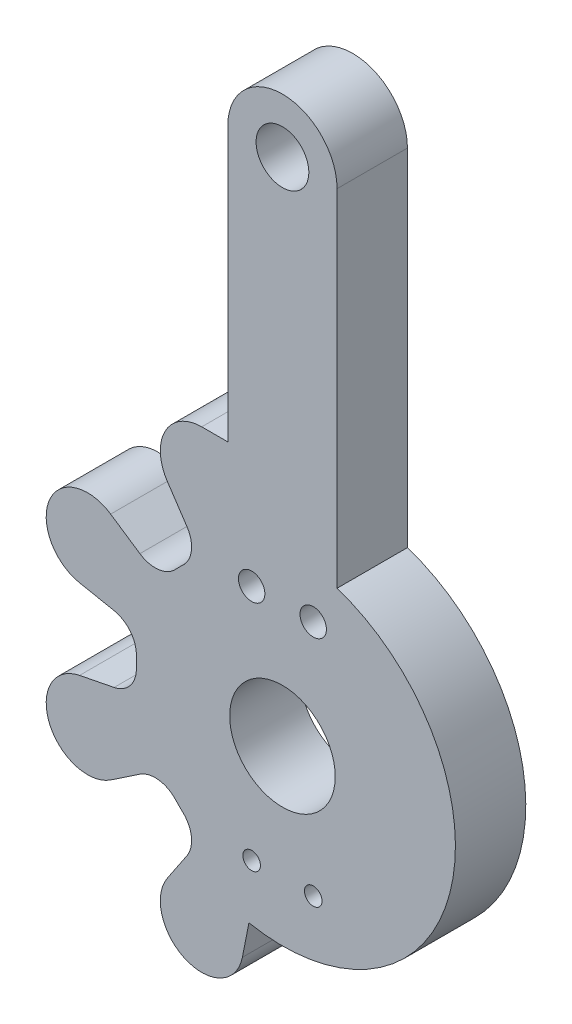
ISO-10303-21;
HEADER;
FILE_DESCRIPTION(('STEP AP214'),'2;1');
FILE_NAME('part.step','',(''),(''),'','','');
FILE_SCHEMA(('AUTOMOTIVE_DESIGN { 1 0 10303 214 1 1 1 1 }'));
ENDSEC;
DATA;
#1=APPLICATION_CONTEXT('core data for automotive mechanical design processes');
#2=APPLICATION_PROTOCOL_DEFINITION('international standard','automotive_design',2000,#1);
#3=PRODUCT_CONTEXT('',#1,'mechanical');
#4=PRODUCT('Part','Part','',(#3));
#5=PRODUCT_RELATED_PRODUCT_CATEGORY('part','',(#4));
#6=PRODUCT_DEFINITION_FORMATION('','',#4);
#7=PRODUCT_DEFINITION_CONTEXT('part definition',#1,'design');
#8=PRODUCT_DEFINITION('design','',#6,#7);
#9=PRODUCT_DEFINITION_SHAPE('','',#8);
#10=(LENGTH_UNIT() NAMED_UNIT(*) SI_UNIT(.MILLI.,.METRE.));
#11=(NAMED_UNIT(*) PLANE_ANGLE_UNIT() SI_UNIT($,.RADIAN.));
#12=(NAMED_UNIT(*) SI_UNIT($,.STERADIAN.) SOLID_ANGLE_UNIT());
#13=UNCERTAINTY_MEASURE_WITH_UNIT(LENGTH_MEASURE(1.E-05),#10,'distance_accuracy_value','');
#14=(GEOMETRIC_REPRESENTATION_CONTEXT(3) GLOBAL_UNCERTAINTY_ASSIGNED_CONTEXT((#13)) GLOBAL_UNIT_ASSIGNED_CONTEXT((#10,
#11,#12)) REPRESENTATION_CONTEXT('',''));
#15=CARTESIAN_POINT('',(0.,0.,0.));
#16=DIRECTION('',(0.,0.,1.));
#17=DIRECTION('',(1.,0.,0.));
#18=AXIS2_PLACEMENT_3D('',#15,#16,#17);
#19=CARTESIAN_POINT('',(13.4256193168361,42.4256181900213,4.));
#20=DIRECTION('',(0.,0.,1.));
#21=DIRECTION('',(1.,0.,0.));
#22=AXIS2_PLACEMENT_3D('',#19,#20,#21);
#23=PLANE('',#22);
#24=CARTESIAN_POINT('',(11.6756193168361,6.92561819002131,4.));
#25=DIRECTION('',(0.,0.,1.));
#26=DIRECTION('',(1.,0.,0.));
#27=AXIS2_PLACEMENT_3D('',#24,#25,#26);
#28=CIRCLE('',#27,0.5);
#29=CARTESIAN_POINT('',(12.1756193168361,6.92561819002131,4.));
#30=VERTEX_POINT('',#29);
#31=EDGE_CURVE('E470',#30,#30,#28,.T.);
#32=ORIENTED_EDGE('',*,*,#31,.F.);
#33=EDGE_LOOP('',(#32));
#34=FACE_BOUND('',#33,.T.);
#35=CARTESIAN_POINT('',(11.6756193168361,20.4256181900213,4.));
#36=DIRECTION('',(0.,0.,1.));
#37=DIRECTION('',(1.,0.,0.));
#38=AXIS2_PLACEMENT_3D('',#35,#36,#37);
#39=CIRCLE('',#38,0.750000000000001);
#40=CARTESIAN_POINT('',(12.4256193168361,20.4256181900213,4.));
#41=VERTEX_POINT('',#40);
#42=EDGE_CURVE('E482',#41,#41,#39,.T.);
#43=ORIENTED_EDGE('',*,*,#42,.F.);
#44=EDGE_LOOP('',(#43));
#45=FACE_BOUND('',#44,.T.);
#46=CARTESIAN_POINT('',(13.4256193168361,42.4256181900213,4.));
#47=DIRECTION('',(0.,0.,1.));
#48=DIRECTION('',(1.,0.,0.));
#49=AXIS2_PLACEMENT_3D('',#46,#47,#48);
#50=CIRCLE('',#49,1.5);
#51=CARTESIAN_POINT('',(14.9256193168361,42.4256181900213,4.));
#52=VERTEX_POINT('',#51);
#53=EDGE_CURVE('E235',#52,#52,#50,.T.);
#54=ORIENTED_EDGE('',*,*,#53,.F.);
#55=EDGE_LOOP('',(#54));
#56=FACE_BOUND('',#55,.T.);
#57=CARTESIAN_POINT('',(13.4256193168361,42.4256181900213,4.));
#58=DIRECTION('',(0.,0.,1.));
#59=DIRECTION('',(1.,0.,0.));
#60=AXIS2_PLACEMENT_3D('',#57,#58,#59);
#61=CIRCLE('',#60,3.10499999999996);
#62=CARTESIAN_POINT('',(16.5306193168361,42.4256181900213,4.));
#63=VERTEX_POINT('',#62);
#64=CARTESIAN_POINT('',(10.3206193168362,42.4256181900213,4.));
#65=VERTEX_POINT('',#64);
#66=EDGE_CURVE('E284',#63,#65,#61,.T.);
#67=ORIENTED_EDGE('',*,*,#66,.T.);
#68=DIRECTION('',(0.,-1.,0.));
#69=VECTOR('',#68,1.);
#70=CARTESIAN_POINT('',(10.3206193168362,42.4256181900213,4.));
#71=LINE('',#70,#69);
#72=CARTESIAN_POINT('',(10.3206193168361,26.855582349278,4.));
#73=VERTEX_POINT('',#72);
#74=EDGE_CURVE('E143',#65,#73,#71,.T.);
#75=ORIENTED_EDGE('',*,*,#74,.T.);
#76=DIRECTION('',(-1.,0.,0.));
#77=VECTOR('',#76,1.);
#78=CARTESIAN_POINT('',(8.83778485820932,26.8555823492781,4.));
#79=LINE('',#78,#77);
#80=CARTESIAN_POINT('',(8.83778485820932,26.8555823492781,4.));
#81=VERTEX_POINT('',#80);
#82=EDGE_CURVE('E350',#73,#81,#79,.T.);
#83=ORIENTED_EDGE('',*,*,#82,.T.);
#84=CARTESIAN_POINT('',(8.83778485820932,24.5016303564221,4.));
#85=DIRECTION('',(0.,0.,1.));
#86=DIRECTION('',(1.,0.,0.));
#87=AXIS2_PLACEMENT_3D('',#84,#85,#86);
#88=CIRCLE('',#87,2.35395199285594);
#89=CARTESIAN_POINT('',(6.88222596491778,23.1913329120811,4.));
#90=VERTEX_POINT('',#89);
#91=EDGE_CURVE('E368',#81,#90,#88,.T.);
#92=ORIENTED_EDGE('',*,*,#91,.T.);
#93=DIRECTION('',(0.556637284437096,-0.830755640109951,0.));
#94=VECTOR('',#93,1.);
#95=CARTESIAN_POINT('',(6.88222596491778,23.1913329120811,4.));
#96=LINE('',#95,#94);
#97=CARTESIAN_POINT('',(7.99595022844271,21.5291504859154,4.));
#98=VERTEX_POINT('',#97);
#99=EDGE_CURVE('E365',#90,#98,#96,.T.);
#100=ORIENTED_EDGE('',*,*,#99,.T.);
#101=CARTESIAN_POINT('',(6.69224429888948,20.6556188547153,4.));
#102=DIRECTION('',(0.,0.,-1.));
#103=DIRECTION('',(1.,0.,0.));
#104=AXIS2_PLACEMENT_3D('',#101,#102,#103);
#105=CIRCLE('',#104,1.56930132908229);
#106=CARTESIAN_POINT('',(7.76176504193516,19.5072147254498,4.));
#107=VERTEX_POINT('',#106);
#108=EDGE_CURVE('E367',#98,#107,#105,.T.);
#109=ORIENTED_EDGE('',*,*,#108,.T.);
#110=CARTESIAN_POINT('',(13.4256193168361,13.4256181900213,4.));
#111=DIRECTION('',(0.,0.,1.));
#112=DIRECTION('',(1.,0.,0.));
#113=AXIS2_PLACEMENT_3D('',#110,#111,#112);
#114=CIRCLE('',#113,8.31053919231775);
#115=CARTESIAN_POINT('',(7.34402277875391,19.0894724634508,4.));
#116=VERTEX_POINT('',#115);
#117=EDGE_CURVE('E370',#107,#116,#114,.T.);
#118=ORIENTED_EDGE('',*,*,#117,.T.);
#119=CARTESIAN_POINT('',(6.19561865061559,20.1589932040291,4.));
#120=DIRECTION('',(0.,0.,-1.));
#121=DIRECTION('',(1.,0.,0.));
#122=AXIS2_PLACEMENT_3D('',#119,#120,#121);
#123=CIRCLE('',#122,1.56930132735951);
#124=CARTESIAN_POINT('',(5.32208701898736,18.8552872770917,4.));
#125=VERTEX_POINT('',#124);
#126=EDGE_CURVE('E376',#116,#125,#123,.T.);
#127=ORIENTED_EDGE('',*,*,#126,.T.);
#128=DIRECTION('',(-0.830755639309086,0.556637285632351,0.));
#129=VECTOR('',#128,1.);
#130=CARTESIAN_POINT('',(5.32208701898736,18.8552872770917,4.));
#131=LINE('',#130,#129);
#132=CARTESIAN_POINT('',(3.65990459503346,19.9690115407813,4.));
#133=VERTEX_POINT('',#132);
#134=EDGE_CURVE('E378',#125,#133,#131,.T.);
#135=ORIENTED_EDGE('',*,*,#134,.T.);
#136=CARTESIAN_POINT('',(2.34960714866037,18.0134526470891,4.));
#137=DIRECTION('',(0.,0.,1.));
#138=DIRECTION('',(1.,0.,0.));
#139=AXIS2_PLACEMENT_3D('',#136,#137,#138);
#140=CIRCLE('',#139,2.35395199285594);
#141=CARTESIAN_POINT('',(1.89333840221241,15.7041434812092,4.));
#142=VERTEX_POINT('',#141);
#143=EDGE_CURVE('E380',#133,#142,#140,.T.);
#144=ORIENTED_EDGE('',*,*,#143,.T.);
#145=DIRECTION('',(0.981034945315921,-0.193830947139481,0.));
#146=VECTOR('',#145,1.);
#147=CARTESIAN_POINT('',(1.89333840221241,15.7041434812092,4.));
#148=LINE('',#147,#146);
#149=CARTESIAN_POINT('',(3.8562008473514,15.3163249968511,4.));
#150=VERTEX_POINT('',#149);
#151=EDGE_CURVE('E382',#142,#150,#148,.T.);
#152=ORIENTED_EDGE('',*,*,#151,.T.);
#153=CARTESIAN_POINT('',(3.55202168394419,13.776785553643,4.));
#154=DIRECTION('',(0.,0.,-1.));
#155=DIRECTION('',(1.,0.,0.));
#156=AXIS2_PLACEMENT_3D('',#153,#154,#155);
#157=CIRCLE('',#156,1.56930132882264);
#158=CARTESIAN_POINT('',(5.12033139935397,13.7210065752787,4.));
#159=VERTEX_POINT('',#158);
#160=EDGE_CURVE('E384',#150,#159,#157,.T.);
#161=ORIENTED_EDGE('',*,*,#160,.T.);
#162=CARTESIAN_POINT('',(13.4256193168361,13.4256181900213,4.));
#163=DIRECTION('',(0.,0.,1.));
#164=DIRECTION('',(1.,0.,0.));
#165=AXIS2_PLACEMENT_3D('',#162,#163,#164);
#166=CIRCLE('',#165,8.31053919372381);
#167=CARTESIAN_POINT('',(5.12033139729372,13.1302298030005,4.));
#168=VERTEX_POINT('',#167);
#169=EDGE_CURVE('E386',#159,#168,#166,.T.);
#170=ORIENTED_EDGE('',*,*,#169,.T.);
#171=CARTESIAN_POINT('',(3.55202168223849,13.0744508247259,4.));
#172=DIRECTION('',(0.,0.,-1.));
#173=DIRECTION('',(1.,0.,0.));
#174=AXIS2_PLACEMENT_3D('',#171,#172,#173);
#175=CIRCLE('',#174,1.56930132758307);
#176=CARTESIAN_POINT('',(3.85620084636577,11.5349113829119,4.));
#177=VERTEX_POINT('',#176);
#178=EDGE_CURVE('E388',#168,#177,#175,.T.);
#179=ORIENTED_EDGE('',*,*,#178,.T.);
#180=DIRECTION('',(-0.981034945261507,-0.193830947414888,0.));
#181=VECTOR('',#180,1.);
#182=CARTESIAN_POINT('',(3.85620084636577,11.5349113829119,4.));
#183=LINE('',#182,#181);
#184=CARTESIAN_POINT('',(1.89333840262835,11.1470928969829,4.));
#185=VERTEX_POINT('',#184);
#186=EDGE_CURVE('E390',#177,#185,#183,.T.);
#187=ORIENTED_EDGE('',*,*,#186,.T.);
#188=CARTESIAN_POINT('',(2.34960714766589,8.83778373254167,4.));
#189=DIRECTION('',(0.,0.,1.));
#190=DIRECTION('',(1.,0.,0.));
#191=AXIS2_PLACEMENT_3D('',#188,#189,#190);
#192=CIRCLE('',#191,2.35395199285594);
#193=CARTESIAN_POINT('',(3.65990459200702,6.88222483925007,4.));
#194=VERTEX_POINT('',#193);
#195=EDGE_CURVE('E392',#185,#194,#192,.T.);
#196=ORIENTED_EDGE('',*,*,#195,.T.);
#197=DIRECTION('',(0.830755640110142,0.556637284436811,0.));
#198=VECTOR('',#197,1.);
#199=CARTESIAN_POINT('',(3.65990459200702,6.88222483925007,4.));
#200=LINE('',#199,#198);
#201=CARTESIAN_POINT('',(5.32208701782638,7.99594910329147,4.));
#202=VERTEX_POINT('',#201);
#203=EDGE_CURVE('E394',#194,#202,#200,.T.);
#204=ORIENTED_EDGE('',*,*,#203,.T.);
#205=CARTESIAN_POINT('',(6.1956186493731,6.69224317322112,4.));
#206=DIRECTION('',(0.,0.,-1.));
#207=DIRECTION('',(1.,0.,0.));
#208=AXIS2_PLACEMENT_3D('',#205,#206,#207);
#209=CIRCLE('',#208,1.56930132970481);
#210=CARTESIAN_POINT('',(7.34402278102402,7.76176391476325,4.));
#211=VERTEX_POINT('',#210);
#212=EDGE_CURVE('E396',#202,#211,#209,.T.);
#213=ORIENTED_EDGE('',*,*,#212,.T.);
#214=CARTESIAN_POINT('',(13.4256193168361,13.4256181900213,4.));
#215=DIRECTION('',(0.,0.,1.));
#216=DIRECTION('',(1.,0.,0.));
#217=AXIS2_PLACEMENT_3D('',#214,#215,#216);
#218=CIRCLE('',#217,8.31053919284186);
#219=CARTESIAN_POINT('',(7.76176504063742,7.34402165308573,4.));
#220=VERTEX_POINT('',#219);
#221=EDGE_CURVE('E398',#211,#220,#218,.T.);
#222=ORIENTED_EDGE('',*,*,#221,.T.);
#223=CARTESIAN_POINT('',(6.69224430005909,6.19561752494741,4.));
#224=DIRECTION('',(0.,0.,-1.));
#225=DIRECTION('',(1.,0.,0.));
#226=AXIS2_PLACEMENT_3D('',#223,#224,#225);
#227=CIRCLE('',#226,1.56930132735952);
#228=CARTESIAN_POINT('',(7.9959502269968,5.32208589331963,4.));
#229=VERTEX_POINT('',#228);
#230=EDGE_CURVE('E400',#220,#229,#227,.T.);
#231=ORIENTED_EDGE('',*,*,#230,.T.);
#232=DIRECTION('',(-0.556637284412138,-0.830755640126674,0.));
#233=VECTOR('',#232,1.);
#234=CARTESIAN_POINT('',(7.9959502269968,5.32208589331963,4.));
#235=LINE('',#234,#233);
#236=CARTESIAN_POINT('',(6.88222596607577,3.65990346821818,4.));
#237=VERTEX_POINT('',#236);
#238=EDGE_CURVE('E402',#229,#237,#235,.T.);
#239=ORIENTED_EDGE('',*,*,#238,.T.);
#240=CARTESIAN_POINT('',(8.83778485976802,2.34960602184518,4.));
#241=DIRECTION('',(0.,0.,1.));
#242=DIRECTION('',(1.,0.,0.));
#243=AXIS2_PLACEMENT_3D('',#240,#241,#242);
#244=CIRCLE('',#243,2.35395199285594);
#245=CARTESIAN_POINT('',(11.1470940228792,1.89333727654427,4.));
#246=VERTEX_POINT('',#245);
#247=EDGE_CURVE('E213',#237,#246,#244,.T.);
#248=ORIENTED_EDGE('',*,*,#247,.T.);
#249=DIRECTION('',(0.193830947347397,0.981034945274841,0.));
#250=VECTOR('',#249,1.);
#251=CARTESIAN_POINT('',(11.1470940228792,1.89333727654427,4.));
#252=LINE('',#251,#250);
#253=CARTESIAN_POINT('',(11.519776524562,3.77959209109658,4.));
#254=VERTEX_POINT('',#253);
#255=EDGE_CURVE('E207',#246,#254,#252,.T.);
#256=ORIENTED_EDGE('',*,*,#255,.T.);
#257=CARTESIAN_POINT('',(13.4256193168361,13.4256181900213,4.));
#258=DIRECTION('',(0.,0.,1.));
#259=DIRECTION('',(1.,0.,0.));
#260=AXIS2_PLACEMENT_3D('',#257,#258,#259);
#261=CIRCLE('',#260,9.83250000000001);
#262=CARTESIAN_POINT('',(16.5306193168361,22.7549821152844,4.));
#263=VERTEX_POINT('',#262);
#264=EDGE_CURVE('E211',#254,#263,#261,.T.);
#265=ORIENTED_EDGE('',*,*,#264,.T.);
#266=DIRECTION('',(0.,1.,0.));
#267=VECTOR('',#266,1.);
#268=CARTESIAN_POINT('',(16.5306193168361,42.4256181900213,4.));
#269=LINE('',#268,#267);
#270=EDGE_CURVE('E49',#263,#63,#269,.T.);
#271=ORIENTED_EDGE('',*,*,#270,.T.);
#272=EDGE_LOOP('',(#67,#75,#83,#92,#100,#109,#118,#127,#135,#144,#152,#161,#170,#179,#187,#196,
#204,#213,#222,#231,#239,#248,#256,#265,#271));
#273=FACE_BOUND('',#272,.T.);
#274=CARTESIAN_POINT('',(13.4256193168361,13.4256181900213,4.));
#275=DIRECTION('',(0.,0.,1.));
#276=DIRECTION('',(1.,0.,0.));
#277=AXIS2_PLACEMENT_3D('',#274,#275,#276);
#278=CIRCLE('',#277,3.);
#279=CARTESIAN_POINT('',(16.4256193168361,13.4256181900213,4.));
#280=VERTEX_POINT('',#279);
#281=EDGE_CURVE('E488',#280,#280,#278,.T.);
#282=ORIENTED_EDGE('',*,*,#281,.F.);
#283=EDGE_LOOP('',(#282));
#284=FACE_BOUND('',#283,.T.);
#285=CARTESIAN_POINT('',(15.175619316836,20.4256181900213,4.));
#286=DIRECTION('',(0.,0.,1.));
#287=DIRECTION('',(1.,0.,0.));
#288=AXIS2_PLACEMENT_3D('',#285,#286,#287);
#289=CIRCLE('',#288,0.750000000000001);
#290=CARTESIAN_POINT('',(15.925619316836,20.4256181900213,4.));
#291=VERTEX_POINT('',#290);
#292=EDGE_CURVE('E476',#291,#291,#289,.T.);
#293=ORIENTED_EDGE('',*,*,#292,.F.);
#294=EDGE_LOOP('',(#293));
#295=FACE_BOUND('',#294,.T.);
#296=CARTESIAN_POINT('',(15.175619316836,6.92561819002131,4.));
#297=DIRECTION('',(0.,0.,1.));
#298=DIRECTION('',(1.,0.,0.));
#299=AXIS2_PLACEMENT_3D('',#296,#297,#298);
#300=CIRCLE('',#299,0.5);
#301=CARTESIAN_POINT('',(15.675619316836,6.92561819002131,4.));
#302=VERTEX_POINT('',#301);
#303=EDGE_CURVE('E461',#302,#302,#300,.T.);
#304=ORIENTED_EDGE('',*,*,#303,.F.);
#305=EDGE_LOOP('',(#304));
#306=FACE_BOUND('',#305,.T.);
#307=ADVANCED_FACE('F32',(#34,#45,#56,#273,#284,#295,#306),#23,.T.);
#308=CARTESIAN_POINT('',(13.4256193168361,42.4256181900213,0.));
#309=DIRECTION('',(0.,0.,1.));
#310=DIRECTION('',(1.,0.,0.));
#311=AXIS2_PLACEMENT_3D('',#308,#309,#310);
#312=PLANE('',#311);
#313=CARTESIAN_POINT('',(11.6756193168361,6.92561819002131,0.));
#314=DIRECTION('',(0.,0.,1.));
#315=DIRECTION('',(1.,0.,0.));
#316=AXIS2_PLACEMENT_3D('',#313,#314,#315);
#317=CIRCLE('',#316,0.5);
#318=CARTESIAN_POINT('',(12.1756193168361,6.92561819002131,0.));
#319=VERTEX_POINT('',#318);
#320=EDGE_CURVE('E467',#319,#319,#317,.T.);
#321=ORIENTED_EDGE('',*,*,#320,.T.);
#322=EDGE_LOOP('',(#321));
#323=FACE_BOUND('',#322,.T.);
#324=CARTESIAN_POINT('',(11.6756193168361,20.4256181900213,0.));
#325=DIRECTION('',(0.,0.,1.));
#326=DIRECTION('',(1.,0.,0.));
#327=AXIS2_PLACEMENT_3D('',#324,#325,#326);
#328=CIRCLE('',#327,0.750000000000001);
#329=CARTESIAN_POINT('',(12.4256193168361,20.4256181900213,0.));
#330=VERTEX_POINT('',#329);
#331=EDGE_CURVE('E479',#330,#330,#328,.T.);
#332=ORIENTED_EDGE('',*,*,#331,.T.);
#333=EDGE_LOOP('',(#332));
#334=FACE_BOUND('',#333,.T.);
#335=CARTESIAN_POINT('',(13.4256193168361,42.4256181900213,0.));
#336=DIRECTION('',(0.,0.,1.));
#337=DIRECTION('',(1.,0.,0.));
#338=AXIS2_PLACEMENT_3D('',#335,#336,#337);
#339=CIRCLE('',#338,1.5);
#340=CARTESIAN_POINT('',(14.9256193168361,42.4256181900213,0.));
#341=VERTEX_POINT('',#340);
#342=EDGE_CURVE('E491',#341,#341,#339,.T.);
#343=ORIENTED_EDGE('',*,*,#342,.T.);
#344=EDGE_LOOP('',(#343));
#345=FACE_BOUND('',#344,.T.);
#346=CARTESIAN_POINT('',(13.4256193168361,42.4256181900213,0.));
#347=DIRECTION('',(0.,0.,1.));
#348=DIRECTION('',(1.,0.,0.));
#349=AXIS2_PLACEMENT_3D('',#346,#347,#348);
#350=CIRCLE('',#349,3.10499999999996);
#351=CARTESIAN_POINT('',(16.5306193168361,42.4256181900213,0.));
#352=VERTEX_POINT('',#351);
#353=CARTESIAN_POINT('',(10.3206193168362,42.4256181900213,0.));
#354=VERTEX_POINT('',#353);
#355=EDGE_CURVE('E231',#352,#354,#350,.T.);
#356=ORIENTED_EDGE('',*,*,#355,.F.);
#357=DIRECTION('',(0.,1.,0.));
#358=VECTOR('',#357,1.);
#359=CARTESIAN_POINT('',(16.5306193168361,42.4256181900213,0.));
#360=LINE('',#359,#358);
#361=CARTESIAN_POINT('',(16.5306193168361,22.7549821152844,0.));
#362=VERTEX_POINT('',#361);
#363=EDGE_CURVE('E135',#362,#352,#360,.T.);
#364=ORIENTED_EDGE('',*,*,#363,.F.);
#365=CARTESIAN_POINT('',(13.4256193168361,13.4256181900213,0.));
#366=DIRECTION('',(0.,0.,1.));
#367=DIRECTION('',(1.,0.,0.));
#368=AXIS2_PLACEMENT_3D('',#365,#366,#367);
#369=CIRCLE('',#368,9.83250000000001);
#370=CARTESIAN_POINT('',(11.519776524562,3.77959209109658,0.));
#371=VERTEX_POINT('',#370);
#372=EDGE_CURVE('E129',#371,#362,#369,.T.);
#373=ORIENTED_EDGE('',*,*,#372,.F.);
#374=DIRECTION('',(0.193830947347397,0.981034945274841,0.));
#375=VECTOR('',#374,1.);
#376=CARTESIAN_POINT('',(11.1470940228792,1.89333727654427,0.));
#377=LINE('',#376,#375);
#378=CARTESIAN_POINT('',(11.1470940228792,1.89333727654427,0.));
#379=VERTEX_POINT('',#378);
#380=EDGE_CURVE('E221',#379,#371,#377,.T.);
#381=ORIENTED_EDGE('',*,*,#380,.F.);
#382=CARTESIAN_POINT('',(8.83778485976802,2.34960602184518,0.));
#383=DIRECTION('',(0.,0.,1.));
#384=DIRECTION('',(1.,0.,0.));
#385=AXIS2_PLACEMENT_3D('',#382,#383,#384);
#386=CIRCLE('',#385,2.35395199222906);
#387=CARTESIAN_POINT('',(6.88222596607577,3.65990346821818,0.));
#388=VERTEX_POINT('',#387);
#389=EDGE_CURVE('E279',#388,#379,#386,.T.);
#390=ORIENTED_EDGE('',*,*,#389,.F.);
#391=DIRECTION('',(-0.556637284412138,-0.830755640126674,0.));
#392=VECTOR('',#391,1.);
#393=CARTESIAN_POINT('',(7.9959502269968,5.32208589331963,0.));
#394=LINE('',#393,#392);
#395=CARTESIAN_POINT('',(7.9959502269968,5.32208589331963,0.));
#396=VERTEX_POINT('',#395);
#397=EDGE_CURVE('E276',#396,#388,#394,.T.);
#398=ORIENTED_EDGE('',*,*,#397,.F.);
#399=CARTESIAN_POINT('',(6.69224430005909,6.19561752494741,0.));
#400=DIRECTION('',(0.,0.,-1.));
#401=DIRECTION('',(1.,0.,0.));
#402=AXIS2_PLACEMENT_3D('',#399,#400,#401);
#403=CIRCLE('',#402,1.56930132735952);
#404=CARTESIAN_POINT('',(7.76176504063742,7.34402165308573,0.));
#405=VERTEX_POINT('',#404);
#406=EDGE_CURVE('E274',#405,#396,#403,.T.);
#407=ORIENTED_EDGE('',*,*,#406,.F.);
#408=CARTESIAN_POINT('',(13.4256193168361,13.4256181900213,0.));
#409=DIRECTION('',(0.,0.,1.));
#410=DIRECTION('',(1.,0.,0.));
#411=AXIS2_PLACEMENT_3D('',#408,#409,#410);
#412=CIRCLE('',#411,8.31053919284186);
#413=CARTESIAN_POINT('',(7.34402278102402,7.76176391476325,0.));
#414=VERTEX_POINT('',#413);
#415=EDGE_CURVE('E272',#414,#405,#412,.T.);
#416=ORIENTED_EDGE('',*,*,#415,.F.);
#417=CARTESIAN_POINT('',(6.1956186493731,6.69224317322112,0.));
#418=DIRECTION('',(0.,0.,-1.));
#419=DIRECTION('',(1.,0.,0.));
#420=AXIS2_PLACEMENT_3D('',#417,#418,#419);
#421=CIRCLE('',#420,1.56930132970481);
#422=CARTESIAN_POINT('',(5.32208701782638,7.99594910329147,0.));
#423=VERTEX_POINT('',#422);
#424=EDGE_CURVE('E270',#423,#414,#421,.T.);
#425=ORIENTED_EDGE('',*,*,#424,.F.);
#426=DIRECTION('',(0.830755640110142,0.556637284436811,0.));
#427=VECTOR('',#426,1.);
#428=CARTESIAN_POINT('',(3.65990459200702,6.88222483925007,0.));
#429=LINE('',#428,#427);
#430=CARTESIAN_POINT('',(3.65990459200702,6.88222483925007,0.));
#431=VERTEX_POINT('',#430);
#432=EDGE_CURVE('E268',#431,#423,#429,.T.);
#433=ORIENTED_EDGE('',*,*,#432,.F.);
#434=CARTESIAN_POINT('',(2.34960714766589,8.83778373254167,0.));
#435=DIRECTION('',(0.,0.,1.));
#436=DIRECTION('',(1.,0.,0.));
#437=AXIS2_PLACEMENT_3D('',#434,#435,#436);
#438=CIRCLE('',#437,2.35395199212401);
#439=CARTESIAN_POINT('',(1.89333840262835,11.1470928969829,0.));
#440=VERTEX_POINT('',#439);
#441=EDGE_CURVE('E266',#440,#431,#438,.T.);
#442=ORIENTED_EDGE('',*,*,#441,.F.);
#443=DIRECTION('',(-0.981034945261507,-0.193830947414888,0.));
#444=VECTOR('',#443,1.);
#445=CARTESIAN_POINT('',(3.85620084636577,11.5349113829119,0.));
#446=LINE('',#445,#444);
#447=CARTESIAN_POINT('',(3.85620084636577,11.5349113829119,0.));
#448=VERTEX_POINT('',#447);
#449=EDGE_CURVE('E263',#448,#440,#446,.T.);
#450=ORIENTED_EDGE('',*,*,#449,.F.);
#451=CARTESIAN_POINT('',(3.55202168223849,13.0744508247259,0.));
#452=DIRECTION('',(0.,0.,-1.));
#453=DIRECTION('',(1.,0.,0.));
#454=AXIS2_PLACEMENT_3D('',#451,#452,#453);
#455=CIRCLE('',#454,1.56930132758307);
#456=CARTESIAN_POINT('',(5.12033139729372,13.1302298030005,0.));
#457=VERTEX_POINT('',#456);
#458=EDGE_CURVE('E261',#457,#448,#455,.T.);
#459=ORIENTED_EDGE('',*,*,#458,.F.);
#460=CARTESIAN_POINT('',(13.4256193168361,13.4256181900213,0.));
#461=DIRECTION('',(0.,0.,1.));
#462=DIRECTION('',(1.,0.,0.));
#463=AXIS2_PLACEMENT_3D('',#460,#461,#462);
#464=CIRCLE('',#463,8.31053919372381);
#465=CARTESIAN_POINT('',(5.12033139935397,13.7210065752787,0.));
#466=VERTEX_POINT('',#465);
#467=EDGE_CURVE('E259',#466,#457,#464,.T.);
#468=ORIENTED_EDGE('',*,*,#467,.F.);
#469=CARTESIAN_POINT('',(3.55202168394419,13.776785553643,0.));
#470=DIRECTION('',(0.,0.,-1.));
#471=DIRECTION('',(1.,0.,0.));
#472=AXIS2_PLACEMENT_3D('',#469,#470,#471);
#473=CIRCLE('',#472,1.56930132882264);
#474=CARTESIAN_POINT('',(3.8562008473514,15.3163249968511,0.));
#475=VERTEX_POINT('',#474);
#476=EDGE_CURVE('E257',#475,#466,#473,.T.);
#477=ORIENTED_EDGE('',*,*,#476,.F.);
#478=DIRECTION('',(0.981034945315921,-0.193830947139481,0.));
#479=VECTOR('',#478,1.);
#480=CARTESIAN_POINT('',(1.89333840221241,15.7041434812092,0.));
#481=LINE('',#480,#479);
#482=CARTESIAN_POINT('',(1.89333840221241,15.7041434812092,0.));
#483=VERTEX_POINT('',#482);
#484=EDGE_CURVE('E255',#483,#475,#481,.T.);
#485=ORIENTED_EDGE('',*,*,#484,.F.);
#486=CARTESIAN_POINT('',(2.34960714866037,18.0134526470891,0.));
#487=DIRECTION('',(0.,0.,1.));
#488=DIRECTION('',(1.,0.,0.));
#489=AXIS2_PLACEMENT_3D('',#486,#487,#488);
#490=CIRCLE('',#489,2.35395199369835);
#491=CARTESIAN_POINT('',(3.65990459503346,19.9690115407813,0.));
#492=VERTEX_POINT('',#491);
#493=EDGE_CURVE('E253',#492,#483,#490,.T.);
#494=ORIENTED_EDGE('',*,*,#493,.F.);
#495=DIRECTION('',(-0.830755639309086,0.556637285632351,0.));
#496=VECTOR('',#495,1.);
#497=CARTESIAN_POINT('',(5.32208701898736,18.8552872770917,0.));
#498=LINE('',#497,#496);
#499=CARTESIAN_POINT('',(5.32208701898736,18.8552872770917,0.));
#500=VERTEX_POINT('',#499);
#501=EDGE_CURVE('E250',#500,#492,#498,.T.);
#502=ORIENTED_EDGE('',*,*,#501,.F.);
#503=CARTESIAN_POINT('',(6.19561865061559,20.1589932040291,0.));
#504=DIRECTION('',(0.,0.,-1.));
#505=DIRECTION('',(1.,0.,0.));
#506=AXIS2_PLACEMENT_3D('',#503,#504,#505);
#507=CIRCLE('',#506,1.56930132735951);
#508=CARTESIAN_POINT('',(7.34402277875391,19.0894724634508,0.));
#509=VERTEX_POINT('',#508);
#510=EDGE_CURVE('E248',#509,#500,#507,.T.);
#511=ORIENTED_EDGE('',*,*,#510,.F.);
#512=CARTESIAN_POINT('',(13.4256193168361,13.4256181900213,0.));
#513=DIRECTION('',(0.,0.,1.));
#514=DIRECTION('',(1.,0.,0.));
#515=AXIS2_PLACEMENT_3D('',#512,#513,#514);
#516=CIRCLE('',#515,8.31053919231775);
#517=CARTESIAN_POINT('',(7.76176504193516,19.5072147254498,0.));
#518=VERTEX_POINT('',#517);
#519=EDGE_CURVE('E246',#518,#509,#516,.T.);
#520=ORIENTED_EDGE('',*,*,#519,.F.);
#521=CARTESIAN_POINT('',(6.69224429888948,20.6556188547153,0.));
#522=DIRECTION('',(0.,0.,-1.));
#523=DIRECTION('',(1.,0.,0.));
#524=AXIS2_PLACEMENT_3D('',#521,#522,#523);
#525=CIRCLE('',#524,1.56930132908229);
#526=CARTESIAN_POINT('',(7.99595022844271,21.5291504859154,0.));
#527=VERTEX_POINT('',#526);
#528=EDGE_CURVE('E244',#527,#518,#525,.T.);
#529=ORIENTED_EDGE('',*,*,#528,.F.);
#530=DIRECTION('',(0.556637284437096,-0.830755640109951,0.));
#531=VECTOR('',#530,1.);
#532=CARTESIAN_POINT('',(6.88222596491778,23.1913329120811,0.));
#533=LINE('',#532,#531);
#534=CARTESIAN_POINT('',(6.88222596491778,23.1913329120811,0.));
#535=VERTEX_POINT('',#534);
#536=EDGE_CURVE('E242',#535,#527,#533,.T.);
#537=ORIENTED_EDGE('',*,*,#536,.F.);
#538=CARTESIAN_POINT('',(8.83778485820932,24.5016303564221,0.));
#539=DIRECTION('',(0.,0.,1.));
#540=DIRECTION('',(1.,0.,0.));
#541=AXIS2_PLACEMENT_3D('',#538,#539,#540);
#542=CIRCLE('',#541,2.35395199212396);
#543=CARTESIAN_POINT('',(8.83778485820932,26.8555823492781,0.));
#544=VERTEX_POINT('',#543);
#545=EDGE_CURVE('E240',#544,#535,#542,.T.);
#546=ORIENTED_EDGE('',*,*,#545,.F.);
#547=DIRECTION('',(-1.,0.,0.));
#548=VECTOR('',#547,1.);
#549=CARTESIAN_POINT('',(8.83778485820932,26.8555823492781,0.));
#550=LINE('',#549,#548);
#551=CARTESIAN_POINT('',(10.3206193168361,26.855582349278,0.));
#552=VERTEX_POINT('',#551);
#553=EDGE_CURVE('E237',#552,#544,#550,.T.);
#554=ORIENTED_EDGE('',*,*,#553,.F.);
#555=DIRECTION('',(0.,-1.,0.));
#556=VECTOR('',#555,1.);
#557=CARTESIAN_POINT('',(10.3206193168362,42.4256181900213,0.));
#558=LINE('',#557,#556);
#559=EDGE_CURVE('E234',#354,#552,#558,.T.);
#560=ORIENTED_EDGE('',*,*,#559,.F.);
#561=EDGE_LOOP('',(#356,#364,#373,#381,#390,#398,#407,#416,#425,#433,#442,#450,#459,#468,#477,
#485,#494,#502,#511,#520,#529,#537,#546,#554,#560));
#562=FACE_BOUND('',#561,.T.);
#563=CARTESIAN_POINT('',(13.4256193168361,13.4256181900213,0.));
#564=DIRECTION('',(0.,0.,1.));
#565=DIRECTION('',(1.,0.,0.));
#566=AXIS2_PLACEMENT_3D('',#563,#564,#565);
#567=CIRCLE('',#566,3.);
#568=CARTESIAN_POINT('',(16.4256193168361,13.4256181900213,0.));
#569=VERTEX_POINT('',#568);
#570=EDGE_CURVE('E485',#569,#569,#567,.T.);
#571=ORIENTED_EDGE('',*,*,#570,.T.);
#572=EDGE_LOOP('',(#571));
#573=FACE_BOUND('',#572,.T.);
#574=CARTESIAN_POINT('',(15.175619316836,20.4256181900213,0.));
#575=DIRECTION('',(0.,0.,1.));
#576=DIRECTION('',(1.,0.,0.));
#577=AXIS2_PLACEMENT_3D('',#574,#575,#576);
#578=CIRCLE('',#577,0.750000000000001);
#579=CARTESIAN_POINT('',(15.925619316836,20.4256181900213,0.));
#580=VERTEX_POINT('',#579);
#581=EDGE_CURVE('E473',#580,#580,#578,.T.);
#582=ORIENTED_EDGE('',*,*,#581,.T.);
#583=EDGE_LOOP('',(#582));
#584=FACE_BOUND('',#583,.T.);
#585=CARTESIAN_POINT('',(15.175619316836,6.92561819002131,0.));
#586=DIRECTION('',(0.,0.,1.));
#587=DIRECTION('',(1.,0.,0.));
#588=AXIS2_PLACEMENT_3D('',#585,#586,#587);
#589=CIRCLE('',#588,0.5);
#590=CARTESIAN_POINT('',(15.675619316836,6.92561819002131,0.));
#591=VERTEX_POINT('',#590);
#592=EDGE_CURVE('E464',#591,#591,#589,.T.);
#593=ORIENTED_EDGE('',*,*,#592,.T.);
#594=EDGE_LOOP('',(#593));
#595=FACE_BOUND('',#594,.T.);
#596=ADVANCED_FACE('F353',(#323,#334,#345,#562,#573,#584,#595),#312,.F.);
#597=CARTESIAN_POINT('',(13.4256193168361,42.4256181900213,4.));
#598=DIRECTION('',(0.,0.,-1.));
#599=DIRECTION('',(-1.,0.,0.));
#600=AXIS2_PLACEMENT_3D('',#597,#598,#599);
#601=CYLINDRICAL_SURFACE('',#600,3.10499999999996);
#602=ORIENTED_EDGE('',*,*,#355,.T.);
#603=DIRECTION('',(0.,0.,-1.));
#604=VECTOR('',#603,1.);
#605=CARTESIAN_POINT('',(10.3206193168362,42.4256181900213,4.));
#606=LINE('',#605,#604);
#607=EDGE_CURVE('E11',#65,#354,#606,.T.);
#608=ORIENTED_EDGE('',*,*,#607,.F.);
#609=ORIENTED_EDGE('',*,*,#66,.F.);
#610=DIRECTION('',(0.,0.,-1.));
#611=VECTOR('',#610,1.);
#612=CARTESIAN_POINT('',(16.5306193168361,42.4256181900213,4.));
#613=LINE('',#612,#611);
#614=EDGE_CURVE('E227',#63,#352,#613,.T.);
#615=ORIENTED_EDGE('',*,*,#614,.T.);
#616=EDGE_LOOP('',(#602,#608,#609,#615));
#617=FACE_BOUND('',#616,.T.);
#618=ADVANCED_FACE('F34',(#617),#601,.T.);
#619=CARTESIAN_POINT('',(10.3206193168362,42.4256181900213,4.));
#620=DIRECTION('',(1.,0.,0.));
#621=DIRECTION('',(0.,1.,0.));
#622=AXIS2_PLACEMENT_3D('',#619,#620,#621);
#623=PLANE('',#622);
#624=ORIENTED_EDGE('',*,*,#559,.T.);
#625=DIRECTION('',(0.,0.,-1.));
#626=VECTOR('',#625,1.);
#627=CARTESIAN_POINT('',(10.3206193168361,26.855582349278,4.));
#628=LINE('',#627,#626);
#629=EDGE_CURVE('E41',#73,#552,#628,.T.);
#630=ORIENTED_EDGE('',*,*,#629,.F.);
#631=ORIENTED_EDGE('',*,*,#74,.F.);
#632=ORIENTED_EDGE('',*,*,#607,.T.);
#633=EDGE_LOOP('',(#624,#630,#631,#632));
#634=FACE_BOUND('',#633,.T.);
#635=ADVANCED_FACE('F755',(#634),#623,.F.);
#636=CARTESIAN_POINT('',(8.83778485820932,26.8555823492781,4.));
#637=DIRECTION('',(0.,-1.,0.));
#638=DIRECTION('',(1.,0.,0.));
#639=AXIS2_PLACEMENT_3D('',#636,#637,#638);
#640=PLANE('',#639);
#641=ORIENTED_EDGE('',*,*,#553,.T.);
#642=DIRECTION('',(0.,0.,-1.));
#643=VECTOR('',#642,1.);
#644=CARTESIAN_POINT('',(8.83778485820932,26.8555823492781,4.));
#645=LINE('',#644,#643);
#646=EDGE_CURVE('E342',#81,#544,#645,.T.);
#647=ORIENTED_EDGE('',*,*,#646,.F.);
#648=ORIENTED_EDGE('',*,*,#82,.F.);
#649=ORIENTED_EDGE('',*,*,#629,.T.);
#650=EDGE_LOOP('',(#641,#647,#648,#649));
#651=FACE_BOUND('',#650,.T.);
#652=ADVANCED_FACE('F348',(#651),#640,.F.);
#653=CARTESIAN_POINT('',(8.83778485820932,24.5016303564221,4.));
#654=DIRECTION('',(0.,0.,-1.));
#655=DIRECTION('',(-1.,0.,0.));
#656=AXIS2_PLACEMENT_3D('',#653,#654,#655);
#657=CYLINDRICAL_SURFACE('',#656,2.35395199212396);
#658=ORIENTED_EDGE('',*,*,#545,.T.);
#659=DIRECTION('',(0.,0.,-1.));
#660=VECTOR('',#659,1.);
#661=CARTESIAN_POINT('',(6.88222596491778,23.1913329120811,4.));
#662=LINE('',#661,#660);
#663=EDGE_CURVE('E339',#90,#535,#662,.T.);
#664=ORIENTED_EDGE('',*,*,#663,.F.);
#665=ORIENTED_EDGE('',*,*,#91,.F.);
#666=ORIENTED_EDGE('',*,*,#646,.T.);
#667=EDGE_LOOP('',(#658,#664,#665,#666));
#668=FACE_BOUND('',#667,.T.);
#669=ADVANCED_FACE('F359',(#668),#657,.T.);
#670=CARTESIAN_POINT('',(6.88222596491778,23.1913329120811,4.));
#671=DIRECTION('',(0.830755640109951,0.556637284437096,0.));
#672=DIRECTION('',(-0.556637284437096,0.830755640109951,0.));
#673=AXIS2_PLACEMENT_3D('',#670,#671,#672);
#674=PLANE('',#673);
#675=ORIENTED_EDGE('',*,*,#536,.T.);
#676=DIRECTION('',(0.,0.,-1.));
#677=VECTOR('',#676,1.);
#678=CARTESIAN_POINT('',(7.99595022844271,21.5291504859154,4.));
#679=LINE('',#678,#677);
#680=EDGE_CURVE('E336',#98,#527,#679,.T.);
#681=ORIENTED_EDGE('',*,*,#680,.F.);
#682=ORIENTED_EDGE('',*,*,#99,.F.);
#683=ORIENTED_EDGE('',*,*,#663,.T.);
#684=EDGE_LOOP('',(#675,#681,#682,#683));
#685=FACE_BOUND('',#684,.T.);
#686=ADVANCED_FACE('F363',(#685),#674,.F.);
#687=CARTESIAN_POINT('',(6.69224429888948,20.6556188547153,4.));
#688=DIRECTION('',(0.,0.,-1.));
#689=DIRECTION('',(-1.,0.,0.));
#690=AXIS2_PLACEMENT_3D('',#687,#688,#689);
#691=CYLINDRICAL_SURFACE('',#690,1.56930132908229);
#692=ORIENTED_EDGE('',*,*,#528,.T.);
#693=DIRECTION('',(0.,0.,-1.));
#694=VECTOR('',#693,1.);
#695=CARTESIAN_POINT('',(7.76176504193516,19.5072147254498,4.));
#696=LINE('',#695,#694);
#697=EDGE_CURVE('E333',#107,#518,#696,.T.);
#698=ORIENTED_EDGE('',*,*,#697,.F.);
#699=ORIENTED_EDGE('',*,*,#108,.F.);
#700=ORIENTED_EDGE('',*,*,#680,.T.);
#701=EDGE_LOOP('',(#692,#698,#699,#700));
#702=FACE_BOUND('',#701,.T.);
#703=ADVANCED_FACE('F719',(#702),#691,.F.);
#704=CARTESIAN_POINT('',(13.4256193168361,13.4256181900213,4.));
#705=DIRECTION('',(0.,0.,-1.));
#706=DIRECTION('',(-1.,0.,0.));
#707=AXIS2_PLACEMENT_3D('',#704,#705,#706);
#708=CYLINDRICAL_SURFACE('',#707,8.31053919231775);
#709=ORIENTED_EDGE('',*,*,#519,.T.);
#710=DIRECTION('',(0.,0.,-1.));
#711=VECTOR('',#710,1.);
#712=CARTESIAN_POINT('',(7.34402277875391,19.0894724634508,4.));
#713=LINE('',#712,#711);
#714=EDGE_CURVE('E330',#116,#509,#713,.T.);
#715=ORIENTED_EDGE('',*,*,#714,.F.);
#716=ORIENTED_EDGE('',*,*,#117,.F.);
#717=ORIENTED_EDGE('',*,*,#697,.T.);
#718=EDGE_LOOP('',(#709,#715,#716,#717));
#719=FACE_BOUND('',#718,.T.);
#720=ADVANCED_FACE('F709',(#719),#708,.T.);
#721=CARTESIAN_POINT('',(6.19561865061559,20.1589932040291,4.));
#722=DIRECTION('',(0.,0.,-1.));
#723=DIRECTION('',(-1.,0.,0.));
#724=AXIS2_PLACEMENT_3D('',#721,#722,#723);
#725=CYLINDRICAL_SURFACE('',#724,1.56930132735951);
#726=ORIENTED_EDGE('',*,*,#510,.T.);
#727=DIRECTION('',(0.,0.,-1.));
#728=VECTOR('',#727,1.);
#729=CARTESIAN_POINT('',(5.32208701898736,18.8552872770917,4.));
#730=LINE('',#729,#728);
#731=EDGE_CURVE('E327',#125,#500,#730,.T.);
#732=ORIENTED_EDGE('',*,*,#731,.F.);
#733=ORIENTED_EDGE('',*,*,#126,.F.);
#734=ORIENTED_EDGE('',*,*,#714,.T.);
#735=EDGE_LOOP('',(#726,#732,#733,#734));
#736=FACE_BOUND('',#735,.T.);
#737=ADVANCED_FACE('F698',(#736),#725,.F.);
#738=CARTESIAN_POINT('',(5.32208701898736,18.8552872770917,4.));
#739=DIRECTION('',(-0.556637285632351,-0.830755639309086,0.));
#740=DIRECTION('',(0.830755639309086,-0.556637285632351,0.));
#741=AXIS2_PLACEMENT_3D('',#738,#739,#740);
#742=PLANE('',#741);
#743=ORIENTED_EDGE('',*,*,#501,.T.);
#744=DIRECTION('',(0.,0.,-1.));
#745=VECTOR('',#744,1.);
#746=CARTESIAN_POINT('',(3.65990459503346,19.9690115407813,4.));
#747=LINE('',#746,#745);
#748=EDGE_CURVE('E324',#133,#492,#747,.T.);
#749=ORIENTED_EDGE('',*,*,#748,.F.);
#750=ORIENTED_EDGE('',*,*,#134,.F.);
#751=ORIENTED_EDGE('',*,*,#731,.T.);
#752=EDGE_LOOP('',(#743,#749,#750,#751));
#753=FACE_BOUND('',#752,.T.);
#754=ADVANCED_FACE('F687',(#753),#742,.F.);
#755=CARTESIAN_POINT('',(2.34960714866037,18.0134526470891,4.));
#756=DIRECTION('',(0.,0.,-1.));
#757=DIRECTION('',(-1.,0.,0.));
#758=AXIS2_PLACEMENT_3D('',#755,#756,#757);
#759=CYLINDRICAL_SURFACE('',#758,2.35395199369835);
#760=ORIENTED_EDGE('',*,*,#493,.T.);
#761=DIRECTION('',(0.,0.,-1.));
#762=VECTOR('',#761,1.);
#763=CARTESIAN_POINT('',(1.89333840221241,15.7041434812092,4.));
#764=LINE('',#763,#762);
#765=EDGE_CURVE('E321',#142,#483,#764,.T.);
#766=ORIENTED_EDGE('',*,*,#765,.F.);
#767=ORIENTED_EDGE('',*,*,#143,.F.);
#768=ORIENTED_EDGE('',*,*,#748,.T.);
#769=EDGE_LOOP('',(#760,#766,#767,#768));
#770=FACE_BOUND('',#769,.T.);
#771=ADVANCED_FACE('F677',(#770),#759,.T.);
#772=CARTESIAN_POINT('',(1.89333840221241,15.7041434812092,4.));
#773=DIRECTION('',(0.193830947139481,0.981034945315921,0.));
#774=DIRECTION('',(-0.981034945315921,0.193830947139481,0.));
#775=AXIS2_PLACEMENT_3D('',#772,#773,#774);
#776=PLANE('',#775);
#777=ORIENTED_EDGE('',*,*,#484,.T.);
#778=DIRECTION('',(0.,0.,-1.));
#779=VECTOR('',#778,1.);
#780=CARTESIAN_POINT('',(3.8562008473514,15.3163249968511,4.));
#781=LINE('',#780,#779);
#782=EDGE_CURVE('E318',#150,#475,#781,.T.);
#783=ORIENTED_EDGE('',*,*,#782,.F.);
#784=ORIENTED_EDGE('',*,*,#151,.F.);
#785=ORIENTED_EDGE('',*,*,#765,.T.);
#786=EDGE_LOOP('',(#777,#783,#784,#785));
#787=FACE_BOUND('',#786,.T.);
#788=ADVANCED_FACE('F667',(#787),#776,.F.);
#789=CARTESIAN_POINT('',(3.55202168394419,13.776785553643,4.));
#790=DIRECTION('',(0.,0.,-1.));
#791=DIRECTION('',(-1.,0.,0.));
#792=AXIS2_PLACEMENT_3D('',#789,#790,#791);
#793=CYLINDRICAL_SURFACE('',#792,1.56930132882264);
#794=ORIENTED_EDGE('',*,*,#476,.T.);
#795=DIRECTION('',(0.,0.,-1.));
#796=VECTOR('',#795,1.);
#797=CARTESIAN_POINT('',(5.12033139935397,13.7210065752787,4.));
#798=LINE('',#797,#796);
#799=EDGE_CURVE('E315',#159,#466,#798,.T.);
#800=ORIENTED_EDGE('',*,*,#799,.F.);
#801=ORIENTED_EDGE('',*,*,#160,.F.);
#802=ORIENTED_EDGE('',*,*,#782,.T.);
#803=EDGE_LOOP('',(#794,#800,#801,#802));
#804=FACE_BOUND('',#803,.T.);
#805=ADVANCED_FACE('F657',(#804),#793,.F.);
#806=CARTESIAN_POINT('',(13.4256193168361,13.4256181900213,4.));
#807=DIRECTION('',(0.,0.,-1.));
#808=DIRECTION('',(-1.,0.,0.));
#809=AXIS2_PLACEMENT_3D('',#806,#807,#808);
#810=CYLINDRICAL_SURFACE('',#809,8.31053919372381);
#811=ORIENTED_EDGE('',*,*,#467,.T.);
#812=DIRECTION('',(0.,0.,-1.));
#813=VECTOR('',#812,1.);
#814=CARTESIAN_POINT('',(5.12033139729372,13.1302298030005,4.));
#815=LINE('',#814,#813);
#816=EDGE_CURVE('E312',#168,#457,#815,.T.);
#817=ORIENTED_EDGE('',*,*,#816,.F.);
#818=ORIENTED_EDGE('',*,*,#169,.F.);
#819=ORIENTED_EDGE('',*,*,#799,.T.);
#820=EDGE_LOOP('',(#811,#817,#818,#819));
#821=FACE_BOUND('',#820,.T.);
#822=ADVANCED_FACE('F647',(#821),#810,.T.);
#823=CARTESIAN_POINT('',(3.55202168223849,13.0744508247259,4.));
#824=DIRECTION('',(0.,0.,-1.));
#825=DIRECTION('',(-1.,0.,0.));
#826=AXIS2_PLACEMENT_3D('',#823,#824,#825);
#827=CYLINDRICAL_SURFACE('',#826,1.56930132758307);
#828=ORIENTED_EDGE('',*,*,#458,.T.);
#829=DIRECTION('',(0.,0.,-1.));
#830=VECTOR('',#829,1.);
#831=CARTESIAN_POINT('',(3.85620084636577,11.5349113829119,4.));
#832=LINE('',#831,#830);
#833=EDGE_CURVE('E309',#177,#448,#832,.T.);
#834=ORIENTED_EDGE('',*,*,#833,.F.);
#835=ORIENTED_EDGE('',*,*,#178,.F.);
#836=ORIENTED_EDGE('',*,*,#816,.T.);
#837=EDGE_LOOP('',(#828,#834,#835,#836));
#838=FACE_BOUND('',#837,.T.);
#839=ADVANCED_FACE('F636',(#838),#827,.F.);
#840=CARTESIAN_POINT('',(3.85620084636577,11.5349113829119,4.));
#841=DIRECTION('',(0.193830947414888,-0.981034945261506,0.));
#842=DIRECTION('',(0.981034945261507,0.193830947414888,0.));
#843=AXIS2_PLACEMENT_3D('',#840,#841,#842);
#844=PLANE('',#843);
#845=ORIENTED_EDGE('',*,*,#449,.T.);
#846=DIRECTION('',(0.,0.,-1.));
#847=VECTOR('',#846,1.);
#848=CARTESIAN_POINT('',(1.89333840262835,11.1470928969829,4.));
#849=LINE('',#848,#847);
#850=EDGE_CURVE('E306',#185,#440,#849,.T.);
#851=ORIENTED_EDGE('',*,*,#850,.F.);
#852=ORIENTED_EDGE('',*,*,#186,.F.);
#853=ORIENTED_EDGE('',*,*,#833,.T.);
#854=EDGE_LOOP('',(#845,#851,#852,#853));
#855=FACE_BOUND('',#854,.T.);
#856=ADVANCED_FACE('F625',(#855),#844,.F.);
#857=CARTESIAN_POINT('',(2.34960714766589,8.83778373254167,4.));
#858=DIRECTION('',(0.,0.,-1.));
#859=DIRECTION('',(-1.,0.,0.));
#860=AXIS2_PLACEMENT_3D('',#857,#858,#859);
#861=CYLINDRICAL_SURFACE('',#860,2.35395199212401);
#862=ORIENTED_EDGE('',*,*,#441,.T.);
#863=DIRECTION('',(0.,0.,-1.));
#864=VECTOR('',#863,1.);
#865=CARTESIAN_POINT('',(3.65990459200702,6.88222483925007,4.));
#866=LINE('',#865,#864);
#867=EDGE_CURVE('E303',#194,#431,#866,.T.);
#868=ORIENTED_EDGE('',*,*,#867,.F.);
#869=ORIENTED_EDGE('',*,*,#195,.F.);
#870=ORIENTED_EDGE('',*,*,#850,.T.);
#871=EDGE_LOOP('',(#862,#868,#869,#870));
#872=FACE_BOUND('',#871,.T.);
#873=ADVANCED_FACE('F615',(#872),#861,.T.);
#874=CARTESIAN_POINT('',(3.65990459200702,6.88222483925007,4.));
#875=DIRECTION('',(-0.556637284436811,0.830755640110142,0.));
#876=DIRECTION('',(-0.830755640110142,-0.556637284436811,0.));
#877=AXIS2_PLACEMENT_3D('',#874,#875,#876);
#878=PLANE('',#877);
#879=ORIENTED_EDGE('',*,*,#432,.T.);
#880=DIRECTION('',(0.,0.,-1.));
#881=VECTOR('',#880,1.);
#882=CARTESIAN_POINT('',(5.32208701782638,7.99594910329147,4.));
#883=LINE('',#882,#881);
#884=EDGE_CURVE('E300',#202,#423,#883,.T.);
#885=ORIENTED_EDGE('',*,*,#884,.F.);
#886=ORIENTED_EDGE('',*,*,#203,.F.);
#887=ORIENTED_EDGE('',*,*,#867,.T.);
#888=EDGE_LOOP('',(#879,#885,#886,#887));
#889=FACE_BOUND('',#888,.T.);
#890=ADVANCED_FACE('F605',(#889),#878,.F.);
#891=CARTESIAN_POINT('',(6.1956186493731,6.69224317322112,4.));
#892=DIRECTION('',(0.,0.,-1.));
#893=DIRECTION('',(-1.,0.,0.));
#894=AXIS2_PLACEMENT_3D('',#891,#892,#893);
#895=CYLINDRICAL_SURFACE('',#894,1.56930132970481);
#896=ORIENTED_EDGE('',*,*,#424,.T.);
#897=DIRECTION('',(0.,0.,-1.));
#898=VECTOR('',#897,1.);
#899=CARTESIAN_POINT('',(7.34402278102402,7.76176391476325,4.));
#900=LINE('',#899,#898);
#901=EDGE_CURVE('E297',#211,#414,#900,.T.);
#902=ORIENTED_EDGE('',*,*,#901,.F.);
#903=ORIENTED_EDGE('',*,*,#212,.F.);
#904=ORIENTED_EDGE('',*,*,#884,.T.);
#905=EDGE_LOOP('',(#896,#902,#903,#904));
#906=FACE_BOUND('',#905,.T.);
#907=ADVANCED_FACE('F595',(#906),#895,.F.);
#908=CARTESIAN_POINT('',(13.4256193168361,13.4256181900213,4.));
#909=DIRECTION('',(0.,0.,-1.));
#910=DIRECTION('',(-1.,0.,0.));
#911=AXIS2_PLACEMENT_3D('',#908,#909,#910);
#912=CYLINDRICAL_SURFACE('',#911,8.31053919284186);
#913=ORIENTED_EDGE('',*,*,#415,.T.);
#914=DIRECTION('',(0.,0.,-1.));
#915=VECTOR('',#914,1.);
#916=CARTESIAN_POINT('',(7.76176504063742,7.34402165308573,4.));
#917=LINE('',#916,#915);
#918=EDGE_CURVE('E294',#220,#405,#917,.T.);
#919=ORIENTED_EDGE('',*,*,#918,.F.);
#920=ORIENTED_EDGE('',*,*,#221,.F.);
#921=ORIENTED_EDGE('',*,*,#901,.T.);
#922=EDGE_LOOP('',(#913,#919,#920,#921));
#923=FACE_BOUND('',#922,.T.);
#924=ADVANCED_FACE('F585',(#923),#912,.T.);
#925=CARTESIAN_POINT('',(6.69224430005909,6.19561752494741,4.));
#926=DIRECTION('',(0.,0.,-1.));
#927=DIRECTION('',(-1.,0.,0.));
#928=AXIS2_PLACEMENT_3D('',#925,#926,#927);
#929=CYLINDRICAL_SURFACE('',#928,1.56930132735952);
#930=ORIENTED_EDGE('',*,*,#406,.T.);
#931=DIRECTION('',(0.,0.,-1.));
#932=VECTOR('',#931,1.);
#933=CARTESIAN_POINT('',(7.9959502269968,5.32208589331963,4.));
#934=LINE('',#933,#932);
#935=EDGE_CURVE('E291',#229,#396,#934,.T.);
#936=ORIENTED_EDGE('',*,*,#935,.F.);
#937=ORIENTED_EDGE('',*,*,#230,.F.);
#938=ORIENTED_EDGE('',*,*,#918,.T.);
#939=EDGE_LOOP('',(#930,#936,#937,#938));
#940=FACE_BOUND('',#939,.T.);
#941=ADVANCED_FACE('F575',(#940),#929,.F.);
#942=CARTESIAN_POINT('',(7.9959502269968,5.32208589331963,4.));
#943=DIRECTION('',(0.830755640126674,-0.556637284412138,0.));
#944=DIRECTION('',(0.556637284412138,0.830755640126674,0.));
#945=AXIS2_PLACEMENT_3D('',#942,#943,#944);
#946=PLANE('',#945);
#947=ORIENTED_EDGE('',*,*,#397,.T.);
#948=DIRECTION('',(0.,0.,-1.));
#949=VECTOR('',#948,1.);
#950=CARTESIAN_POINT('',(6.88222596607577,3.65990346821818,4.));
#951=LINE('',#950,#949);
#952=EDGE_CURVE('E288',#237,#388,#951,.T.);
#953=ORIENTED_EDGE('',*,*,#952,.F.);
#954=ORIENTED_EDGE('',*,*,#238,.F.);
#955=ORIENTED_EDGE('',*,*,#935,.T.);
#956=EDGE_LOOP('',(#947,#953,#954,#955));
#957=FACE_BOUND('',#956,.T.);
#958=ADVANCED_FACE('F408',(#957),#946,.F.);
#959=CARTESIAN_POINT('',(8.83778485976802,2.34960602184518,4.));
#960=DIRECTION('',(0.,0.,-1.));
#961=DIRECTION('',(-1.,0.,0.));
#962=AXIS2_PLACEMENT_3D('',#959,#960,#961);
#963=CYLINDRICAL_SURFACE('',#962,2.35395199222906);
#964=ORIENTED_EDGE('',*,*,#389,.T.);
#965=DIRECTION('',(0.,0.,-1.));
#966=VECTOR('',#965,1.);
#967=CARTESIAN_POINT('',(11.1470940228792,1.89333727654427,4.));
#968=LINE('',#967,#966);
#969=EDGE_CURVE('E222',#246,#379,#968,.T.);
#970=ORIENTED_EDGE('',*,*,#969,.F.);
#971=ORIENTED_EDGE('',*,*,#247,.F.);
#972=ORIENTED_EDGE('',*,*,#952,.T.);
#973=EDGE_LOOP('',(#964,#970,#971,#972));
#974=FACE_BOUND('',#973,.T.);
#975=ADVANCED_FACE('F411',(#974),#963,.T.);
#976=CARTESIAN_POINT('',(11.1470940228792,1.89333727654427,4.));
#977=DIRECTION('',(-0.981034945274841,0.193830947347397,0.));
#978=DIRECTION('',(-0.193830947347397,-0.981034945274841,0.));
#979=AXIS2_PLACEMENT_3D('',#976,#977,#978);
#980=PLANE('',#979);
#981=ORIENTED_EDGE('',*,*,#380,.T.);
#982=DIRECTION('',(0.,0.,-1.));
#983=VECTOR('',#982,1.);
#984=CARTESIAN_POINT('',(11.519776524562,3.77959209109658,4.));
#985=LINE('',#984,#983);
#986=EDGE_CURVE('E218',#254,#371,#985,.T.);
#987=ORIENTED_EDGE('',*,*,#986,.F.);
#988=ORIENTED_EDGE('',*,*,#255,.F.);
#989=ORIENTED_EDGE('',*,*,#969,.T.);
#990=EDGE_LOOP('',(#981,#987,#988,#989));
#991=FACE_BOUND('',#990,.T.);
#992=ADVANCED_FACE('F219',(#991),#980,.F.);
#993=CARTESIAN_POINT('',(13.4256193168361,13.4256181900213,4.));
#994=DIRECTION('',(0.,0.,-1.));
#995=DIRECTION('',(-1.,0.,0.));
#996=AXIS2_PLACEMENT_3D('',#993,#994,#995);
#997=CYLINDRICAL_SURFACE('',#996,9.83250000000001);
#998=ORIENTED_EDGE('',*,*,#372,.T.);
#999=DIRECTION('',(0.,0.,-1.));
#1000=VECTOR('',#999,1.);
#1001=CARTESIAN_POINT('',(16.5306193168361,22.7549821152844,4.));
#1002=LINE('',#1001,#1000);
#1003=EDGE_CURVE('E223',#263,#362,#1002,.T.);
#1004=ORIENTED_EDGE('',*,*,#1003,.F.);
#1005=ORIENTED_EDGE('',*,*,#264,.F.);
#1006=ORIENTED_EDGE('',*,*,#986,.T.);
#1007=EDGE_LOOP('',(#998,#1004,#1005,#1006));
#1008=FACE_BOUND('',#1007,.T.);
#1009=ADVANCED_FACE('F225',(#1008),#997,.T.);
#1010=CARTESIAN_POINT('',(16.5306193168361,42.4256181900213,4.));
#1011=DIRECTION('',(-1.,0.,0.));
#1012=DIRECTION('',(0.,0.,1.));
#1013=AXIS2_PLACEMENT_3D('',#1010,#1011,#1012);
#1014=PLANE('',#1013);
#1015=ORIENTED_EDGE('',*,*,#363,.T.);
#1016=ORIENTED_EDGE('',*,*,#614,.F.);
#1017=ORIENTED_EDGE('',*,*,#270,.F.);
#1018=ORIENTED_EDGE('',*,*,#1003,.T.);
#1019=EDGE_LOOP('',(#1015,#1016,#1017,#1018));
#1020=FACE_BOUND('',#1019,.T.);
#1021=ADVANCED_FACE('F415',(#1020),#1014,.F.);
#1022=CARTESIAN_POINT('',(13.4256193168361,42.4256181900213,4.));
#1023=DIRECTION('',(0.,0.,-1.));
#1024=DIRECTION('',(-1.,0.,0.));
#1025=AXIS2_PLACEMENT_3D('',#1022,#1023,#1024);
#1026=CYLINDRICAL_SURFACE('',#1025,1.5);
#1027=ORIENTED_EDGE('',*,*,#53,.T.);
#1028=EDGE_LOOP('',(#1027));
#1029=FACE_BOUND('',#1028,.T.);
#1030=ORIENTED_EDGE('',*,*,#342,.F.);
#1031=EDGE_LOOP('',(#1030));
#1032=FACE_BOUND('',#1031,.T.);
#1033=ADVANCED_FACE('F417',(#1029,#1032),#1026,.F.);
#1034=CARTESIAN_POINT('',(13.4256193168361,13.4256181900213,4.));
#1035=DIRECTION('',(0.,0.,-1.));
#1036=DIRECTION('',(-1.,0.,0.));
#1037=AXIS2_PLACEMENT_3D('',#1034,#1035,#1036);
#1038=CYLINDRICAL_SURFACE('',#1037,3.);
#1039=ORIENTED_EDGE('',*,*,#281,.T.);
#1040=EDGE_LOOP('',(#1039));
#1041=FACE_BOUND('',#1040,.T.);
#1042=ORIENTED_EDGE('',*,*,#570,.F.);
#1043=EDGE_LOOP('',(#1042));
#1044=FACE_BOUND('',#1043,.T.);
#1045=ADVANCED_FACE('F423',(#1041,#1044),#1038,.F.);
#1046=CARTESIAN_POINT('',(11.6756193168361,20.4256181900213,4.));
#1047=DIRECTION('',(0.,0.,-1.));
#1048=DIRECTION('',(-1.,0.,0.));
#1049=AXIS2_PLACEMENT_3D('',#1046,#1047,#1048);
#1050=CYLINDRICAL_SURFACE('',#1049,0.750000000000001);
#1051=ORIENTED_EDGE('',*,*,#42,.T.);
#1052=EDGE_LOOP('',(#1051));
#1053=FACE_BOUND('',#1052,.T.);
#1054=ORIENTED_EDGE('',*,*,#331,.F.);
#1055=EDGE_LOOP('',(#1054));
#1056=FACE_BOUND('',#1055,.T.);
#1057=ADVANCED_FACE('F440',(#1053,#1056),#1050,.F.);
#1058=CARTESIAN_POINT('',(15.175619316836,20.4256181900213,4.));
#1059=DIRECTION('',(0.,0.,-1.));
#1060=DIRECTION('',(-1.,0.,0.));
#1061=AXIS2_PLACEMENT_3D('',#1058,#1059,#1060);
#1062=CYLINDRICAL_SURFACE('',#1061,0.750000000000001);
#1063=ORIENTED_EDGE('',*,*,#292,.T.);
#1064=EDGE_LOOP('',(#1063));
#1065=FACE_BOUND('',#1064,.T.);
#1066=ORIENTED_EDGE('',*,*,#581,.F.);
#1067=EDGE_LOOP('',(#1066));
#1068=FACE_BOUND('',#1067,.T.);
#1069=ADVANCED_FACE('F444',(#1065,#1068),#1062,.F.);
#1070=CARTESIAN_POINT('',(11.6756193168361,6.92561819002131,4.));
#1071=DIRECTION('',(0.,0.,-1.));
#1072=DIRECTION('',(-1.,0.,0.));
#1073=AXIS2_PLACEMENT_3D('',#1070,#1071,#1072);
#1074=CYLINDRICAL_SURFACE('',#1073,0.5);
#1075=ORIENTED_EDGE('',*,*,#31,.T.);
#1076=EDGE_LOOP('',(#1075));
#1077=FACE_BOUND('',#1076,.T.);
#1078=ORIENTED_EDGE('',*,*,#320,.F.);
#1079=EDGE_LOOP('',(#1078));
#1080=FACE_BOUND('',#1079,.T.);
#1081=ADVANCED_FACE('F448',(#1077,#1080),#1074,.F.);
#1082=CARTESIAN_POINT('',(15.175619316836,6.92561819002131,4.));
#1083=DIRECTION('',(0.,0.,-1.));
#1084=DIRECTION('',(-1.,0.,0.));
#1085=AXIS2_PLACEMENT_3D('',#1082,#1083,#1084);
#1086=CYLINDRICAL_SURFACE('',#1085,0.5);
#1087=ORIENTED_EDGE('',*,*,#303,.T.);
#1088=EDGE_LOOP('',(#1087));
#1089=FACE_BOUND('',#1088,.T.);
#1090=ORIENTED_EDGE('',*,*,#592,.F.);
#1091=EDGE_LOOP('',(#1090));
#1092=FACE_BOUND('',#1091,.T.);
#1093=ADVANCED_FACE('F452',(#1089,#1092),#1086,.F.);
#1094=CLOSED_SHELL('',(#307,#596,#618,#635,#652,#669,#686,#703,#720,#737,#754,#771,#788,#805,
#822,#839,#856,#873,#890,#907,#924,#941,#958,#975,#992,#1009,#1021,#1033,#1045,#1057,#1069,
#1081,#1093));
#1095=MANIFOLD_SOLID_BREP('B2',#1094);
#1096=ADVANCED_BREP_SHAPE_REPRESENTATION('',(#18,#1095),#14);
#1097=SHAPE_DEFINITION_REPRESENTATION(#9,#1096);
ENDSEC;
END-ISO-10303-21;
